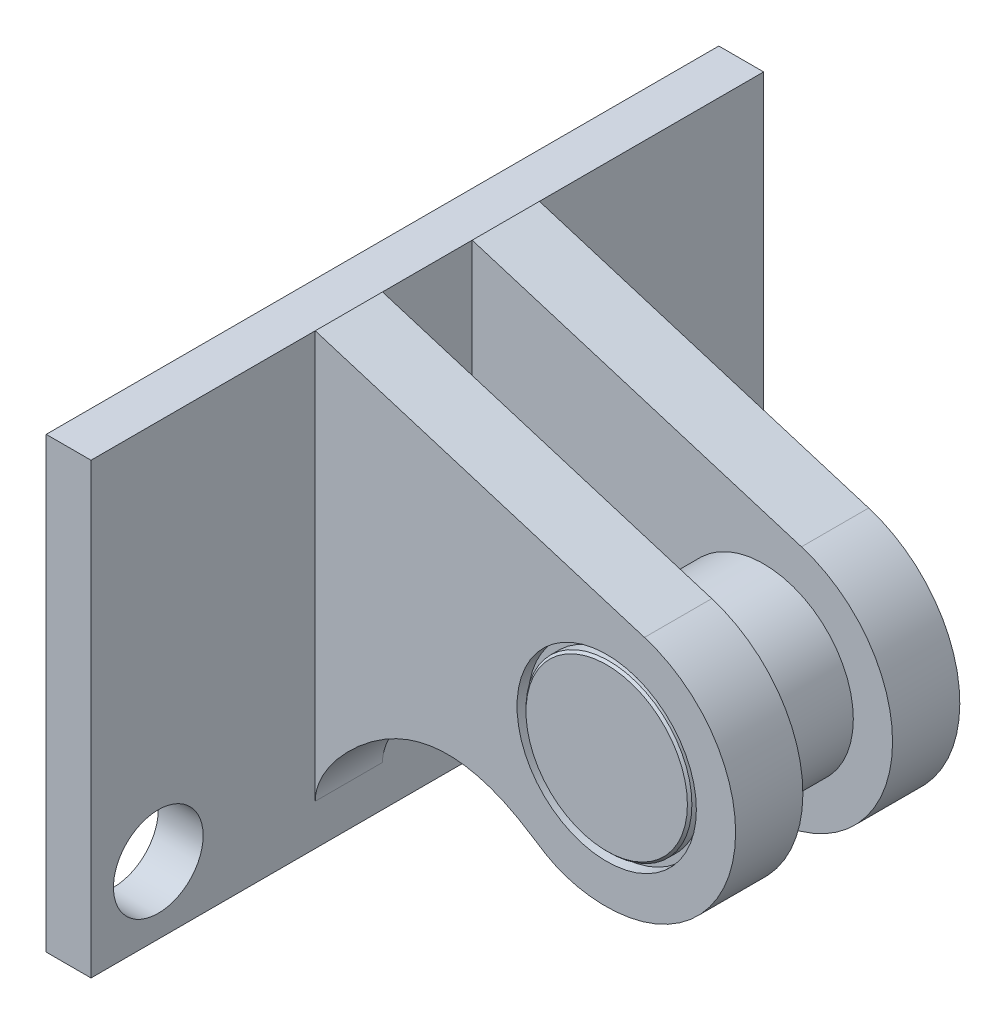
ISO-10303-21;
HEADER;
FILE_DESCRIPTION(('STEP AP214'),'2;1');
FILE_NAME('part.step','',(''),(''),'','','');
FILE_SCHEMA(('AUTOMOTIVE_DESIGN { 1 0 10303 214 1 1 1 1 }'));
ENDSEC;
DATA;
#1=APPLICATION_CONTEXT('core data for automotive mechanical design processes');
#2=APPLICATION_PROTOCOL_DEFINITION('international standard','automotive_design',2000,#1);
#3=PRODUCT_CONTEXT('',#1,'mechanical');
#4=PRODUCT('Part','Part','',(#3));
#5=PRODUCT_RELATED_PRODUCT_CATEGORY('part','',(#4));
#6=PRODUCT_DEFINITION_FORMATION('','',#4);
#7=PRODUCT_DEFINITION_CONTEXT('part definition',#1,'design');
#8=PRODUCT_DEFINITION('design','',#6,#7);
#9=PRODUCT_DEFINITION_SHAPE('','',#8);
#10=(LENGTH_UNIT() NAMED_UNIT(*) SI_UNIT(.MILLI.,.METRE.));
#11=(NAMED_UNIT(*) PLANE_ANGLE_UNIT() SI_UNIT($,.RADIAN.));
#12=(NAMED_UNIT(*) SI_UNIT($,.STERADIAN.) SOLID_ANGLE_UNIT());
#13=UNCERTAINTY_MEASURE_WITH_UNIT(LENGTH_MEASURE(1.E-05),#10,'distance_accuracy_value','');
#14=(GEOMETRIC_REPRESENTATION_CONTEXT(3) GLOBAL_UNCERTAINTY_ASSIGNED_CONTEXT((#13)) GLOBAL_UNIT_ASSIGNED_CONTEXT((#10,
#11,#12)) REPRESENTATION_CONTEXT('',''));
#15=CARTESIAN_POINT('',(0.,0.,0.));
#16=DIRECTION('',(0.,0.,1.));
#17=DIRECTION('',(1.,0.,0.));
#18=AXIS2_PLACEMENT_3D('',#15,#16,#17);
#19=CARTESIAN_POINT('',(19.6597965965987,-12.0057785729841,-16.3137084989848));
#20=DIRECTION('',(0.,0.,1.));
#21=DIRECTION('',(1.,0.,0.));
#22=AXIS2_PLACEMENT_3D('',#19,#20,#21);
#23=CYLINDRICAL_SURFACE('',#22,4.);
#24=CARTESIAN_POINT('',(19.6597965965987,-12.0057785729841,4.5));
#25=DIRECTION('',(0.,0.,1.));
#26=DIRECTION('',(1.,0.,0.));
#27=AXIS2_PLACEMENT_3D('',#24,#25,#26);
#28=CIRCLE('',#27,4.);
#29=CARTESIAN_POINT('',(23.6597965965987,-12.0057785729841,4.5));
#30=VERTEX_POINT('',#29);
#31=EDGE_CURVE('E62',#30,#30,#28,.T.);
#32=ORIENTED_EDGE('',*,*,#31,.F.);
#33=EDGE_LOOP('',(#32));
#34=FACE_BOUND('',#33,.T.);
#35=CARTESIAN_POINT('',(19.6597965965987,-12.0057785729841,-4.5));
#36=DIRECTION('',(0.,0.,1.));
#37=DIRECTION('',(1.,0.,0.));
#38=AXIS2_PLACEMENT_3D('',#35,#36,#37);
#39=CIRCLE('',#38,4.);
#40=CARTESIAN_POINT('',(23.6597965965987,-12.0057785729841,-4.5));
#41=VERTEX_POINT('',#40);
#42=EDGE_CURVE('E68',#41,#41,#39,.T.);
#43=ORIENTED_EDGE('',*,*,#42,.T.);
#44=EDGE_LOOP('',(#43));
#45=FACE_BOUND('',#44,.T.);
#46=ADVANCED_FACE('F42',(#34,#45),#23,.T.);
#47=CARTESIAN_POINT('',(19.6597965965987,-12.0057785729841,4.5));
#48=DIRECTION('',(0.,0.,1.));
#49=DIRECTION('',(1.,0.,0.));
#50=AXIS2_PLACEMENT_3D('',#47,#48,#49);
#51=PLANE('',#50);
#52=CARTESIAN_POINT('',(19.6597965965987,-12.0057785729841,4.5));
#53=DIRECTION('',(0.,0.,1.));
#54=DIRECTION('',(1.,0.,0.));
#55=AXIS2_PLACEMENT_3D('',#52,#53,#54);
#56=CIRCLE('',#55,3.7);
#57=CARTESIAN_POINT('',(23.3597965965987,-12.0057785729841,4.5));
#58=VERTEX_POINT('',#57);
#59=EDGE_CURVE('E65',#58,#58,#56,.T.);
#60=ORIENTED_EDGE('',*,*,#59,.F.);
#61=EDGE_LOOP('',(#60));
#62=FACE_BOUND('',#61,.T.);
#63=ORIENTED_EDGE('',*,*,#31,.T.);
#64=EDGE_LOOP('',(#63));
#65=FACE_BOUND('',#64,.T.);
#66=ADVANCED_FACE('F90',(#62,#65),#51,.T.);
#67=CARTESIAN_POINT('',(19.6597965965987,-12.0057785729841,4.5));
#68=DIRECTION('',(0.,0.,1.));
#69=DIRECTION('',(1.,0.,0.));
#70=AXIS2_PLACEMENT_3D('',#67,#68,#69);
#71=CYLINDRICAL_SURFACE('',#70,3.7);
#72=CARTESIAN_POINT('',(19.6597965965987,-12.0057785729841,4.9));
#73=DIRECTION('',(0.,0.,1.));
#74=DIRECTION('',(1.,0.,0.));
#75=AXIS2_PLACEMENT_3D('',#72,#73,#74);
#76=CIRCLE('',#75,3.7);
#77=CARTESIAN_POINT('',(23.3597965965987,-12.0057785729841,4.9));
#78=VERTEX_POINT('',#77);
#79=EDGE_CURVE('E53',#78,#78,#76,.F.);
#80=ORIENTED_EDGE('',*,*,#79,.T.);
#81=EDGE_LOOP('',(#80));
#82=FACE_BOUND('',#81,.T.);
#83=ORIENTED_EDGE('',*,*,#59,.T.);
#84=EDGE_LOOP('',(#83));
#85=FACE_BOUND('',#84,.T.);
#86=ADVANCED_FACE('F96',(#82,#85),#71,.T.);
#87=CARTESIAN_POINT('',(19.6597965965987,-12.0057785729841,5.));
#88=DIRECTION('',(0.,0.,1.));
#89=DIRECTION('',(1.,0.,0.));
#90=AXIS2_PLACEMENT_3D('',#87,#88,#89);
#91=PLANE('',#90);
#92=CARTESIAN_POINT('',(19.6597965965987,-12.0057785729841,5.));
#93=DIRECTION('',(0.,0.,1.));
#94=DIRECTION('',(1.,0.,0.));
#95=AXIS2_PLACEMENT_3D('',#92,#93,#94);
#96=CIRCLE('',#95,3.6);
#97=CARTESIAN_POINT('',(23.2597965965987,-12.0057785729841,5.));
#98=VERTEX_POINT('',#97);
#99=EDGE_CURVE('E57',#98,#98,#96,.T.);
#100=ORIENTED_EDGE('',*,*,#99,.T.);
#101=EDGE_LOOP('',(#100));
#102=FACE_BOUND('',#101,.T.);
#103=ADVANCED_FACE('F102',(#102),#91,.T.);
#104=CARTESIAN_POINT('',(19.6597965965987,-12.0057785729841,5.));
#105=DIRECTION('',(0.,0.,-1.));
#106=DIRECTION('',(-1.,0.,0.));
#107=AXIS2_PLACEMENT_3D('',#104,#105,#106);
#108=CONICAL_SURFACE('',#107,3.6,0.78539816339745);
#109=ORIENTED_EDGE('',*,*,#79,.F.);
#110=EDGE_LOOP('',(#109));
#111=FACE_BOUND('',#110,.T.);
#112=ORIENTED_EDGE('',*,*,#99,.F.);
#113=EDGE_LOOP('',(#112));
#114=FACE_BOUND('',#113,.T.);
#115=ADVANCED_FACE('F86',(#111,#114),#108,.T.);
#116=CARTESIAN_POINT('',(19.6597965965987,-12.0057785729841,-4.5));
#117=DIRECTION('',(0.,0.,-1.));
#118=DIRECTION('',(1.,0.,0.));
#119=AXIS2_PLACEMENT_3D('',#116,#117,#118);
#120=PLANE('',#119);
#121=ORIENTED_EDGE('',*,*,#42,.F.);
#122=EDGE_LOOP('',(#121));
#123=FACE_BOUND('',#122,.T.);
#124=CARTESIAN_POINT('',(19.6597965965987,-12.0057785729841,-4.5));
#125=DIRECTION('',(0.,0.,1.));
#126=DIRECTION('',(1.,0.,0.));
#127=AXIS2_PLACEMENT_3D('',#124,#125,#126);
#128=CIRCLE('',#127,3.7);
#129=CARTESIAN_POINT('',(23.3597965965987,-12.0057785729841,-4.5));
#130=VERTEX_POINT('',#129);
#131=EDGE_CURVE('E71',#130,#130,#128,.T.);
#132=ORIENTED_EDGE('',*,*,#131,.T.);
#133=EDGE_LOOP('',(#132));
#134=FACE_BOUND('',#133,.T.);
#135=ADVANCED_FACE('F75',(#123,#134),#120,.T.);
#136=CARTESIAN_POINT('',(19.6597965965987,-12.0057785729841,-4.5));
#137=DIRECTION('',(0.,0.,-1.));
#138=DIRECTION('',(-1.,0.,0.));
#139=AXIS2_PLACEMENT_3D('',#136,#137,#138);
#140=CYLINDRICAL_SURFACE('',#139,3.7);
#141=CARTESIAN_POINT('',(19.6597965965987,-12.0057785729841,-4.9));
#142=DIRECTION('',(0.,0.,-1.));
#143=DIRECTION('',(-1.,0.,0.));
#144=AXIS2_PLACEMENT_3D('',#141,#142,#143);
#145=CIRCLE('',#144,3.7);
#146=CARTESIAN_POINT('',(15.9597965965987,-12.0057785729841,-4.9));
#147=VERTEX_POINT('',#146);
#148=EDGE_CURVE('E49',#147,#147,#145,.F.);
#149=ORIENTED_EDGE('',*,*,#148,.T.);
#150=EDGE_LOOP('',(#149));
#151=FACE_BOUND('',#150,.T.);
#152=ORIENTED_EDGE('',*,*,#131,.F.);
#153=EDGE_LOOP('',(#152));
#154=FACE_BOUND('',#153,.T.);
#155=ADVANCED_FACE('F77',(#151,#154),#140,.T.);
#156=CARTESIAN_POINT('',(0.,0.,-5.));
#157=DIRECTION('',(0.,0.,-1.));
#158=DIRECTION('',(1.,0.,0.));
#159=AXIS2_PLACEMENT_3D('',#156,#157,#158);
#160=PLANE('',#159);
#161=CARTESIAN_POINT('',(19.6597965965987,-12.0057785729841,-5.));
#162=DIRECTION('',(0.,0.,-1.));
#163=DIRECTION('',(-1.,0.,0.));
#164=AXIS2_PLACEMENT_3D('',#161,#162,#163);
#165=CIRCLE('',#164,3.6);
#166=CARTESIAN_POINT('',(16.0597965965987,-12.0057785729841,-5.));
#167=VERTEX_POINT('',#166);
#168=EDGE_CURVE('E11',#167,#167,#165,.T.);
#169=ORIENTED_EDGE('',*,*,#168,.T.);
#170=EDGE_LOOP('',(#169));
#171=FACE_BOUND('',#170,.T.);
#172=ADVANCED_FACE('F79',(#171),#160,.T.);
#173=CARTESIAN_POINT('',(19.6597965965987,-12.0057785729841,-4.9));
#174=DIRECTION('',(0.,0.,1.));
#175=DIRECTION('',(1.,0.,0.));
#176=AXIS2_PLACEMENT_3D('',#173,#174,#175);
#177=CONICAL_SURFACE('',#176,3.7,0.785398163397442);
#178=ORIENTED_EDGE('',*,*,#168,.F.);
#179=EDGE_LOOP('',(#178));
#180=FACE_BOUND('',#179,.T.);
#181=ORIENTED_EDGE('',*,*,#148,.F.);
#182=EDGE_LOOP('',(#181));
#183=FACE_BOUND('',#182,.T.);
#184=ADVANCED_FACE('F44',(#180,#183),#177,.T.);
#185=CLOSED_SHELL('',(#46,#66,#86,#103,#115,#135,#155,#172,#184));
#186=MANIFOLD_SOLID_BREP('B2',#185);
#187=CARTESIAN_POINT('',(6.65979659659865,-22.0057785729841,-15.));
#188=DIRECTION('',(0.,0.,1.));
#189=DIRECTION('',(1.,0.,0.));
#190=AXIS2_PLACEMENT_3D('',#187,#188,#189);
#191=PLANE('',#190);
#192=DIRECTION('',(0.,1.,0.));
#193=VECTOR('',#192,1.);
#194=CARTESIAN_POINT('',(4.65979659659865,-22.0057785729841,-15.));
#195=LINE('',#194,#193);
#196=CARTESIAN_POINT('',(4.65979659659865,-22.0057785729841,-15.));
#197=VERTEX_POINT('',#196);
#198=CARTESIAN_POINT('',(4.65979659659865,-2.00577857298413,-15.));
#199=VERTEX_POINT('',#198);
#200=EDGE_CURVE('E363',#197,#199,#195,.T.);
#201=ORIENTED_EDGE('',*,*,#200,.T.);
#202=DIRECTION('',(-1.,0.,0.));
#203=VECTOR('',#202,1.);
#204=CARTESIAN_POINT('',(6.65979659659865,-2.00577857298413,-15.));
#205=LINE('',#204,#203);
#206=CARTESIAN_POINT('',(6.65979659659865,-2.00577857298413,-15.));
#207=VERTEX_POINT('',#206);
#208=EDGE_CURVE('E40',#207,#199,#205,.T.);
#209=ORIENTED_EDGE('',*,*,#208,.F.);
#210=DIRECTION('',(0.,1.,0.));
#211=VECTOR('',#210,1.);
#212=CARTESIAN_POINT('',(6.65979659659865,-22.0057785729841,-15.));
#213=LINE('',#212,#211);
#214=CARTESIAN_POINT('',(6.65979659659865,-22.0057785729841,-15.));
#215=VERTEX_POINT('',#214);
#216=EDGE_CURVE('E372',#215,#207,#213,.T.);
#217=ORIENTED_EDGE('',*,*,#216,.F.);
#218=DIRECTION('',(-1.,0.,0.));
#219=VECTOR('',#218,1.);
#220=CARTESIAN_POINT('',(6.65979659659865,-22.0057785729841,-15.));
#221=LINE('',#220,#219);
#222=EDGE_CURVE('E376',#215,#197,#221,.T.);
#223=ORIENTED_EDGE('',*,*,#222,.T.);
#224=EDGE_LOOP('',(#201,#209,#217,#223));
#225=FACE_BOUND('',#224,.T.);
#226=ADVANCED_FACE('F172',(#225),#191,.F.);
#227=CARTESIAN_POINT('',(6.65979659659865,-2.00577857298413,15.));
#228=DIRECTION('',(0.,-1.,0.));
#229=DIRECTION('',(0.,0.,-1.));
#230=AXIS2_PLACEMENT_3D('',#227,#228,#229);
#231=PLANE('',#230);
#232=DIRECTION('',(0.,0.,1.));
#233=VECTOR('',#232,1.);
#234=CARTESIAN_POINT('',(4.65979659659865,-2.00577857298413,15.));
#235=LINE('',#234,#233);
#236=CARTESIAN_POINT('',(4.65979659659865,-2.00577857298413,15.));
#237=VERTEX_POINT('',#236);
#238=EDGE_CURVE('E353',#199,#237,#235,.T.);
#239=ORIENTED_EDGE('',*,*,#238,.T.);
#240=DIRECTION('',(-1.,0.,0.));
#241=VECTOR('',#240,1.);
#242=CARTESIAN_POINT('',(6.65979659659865,-2.00577857298413,15.));
#243=LINE('',#242,#241);
#244=CARTESIAN_POINT('',(6.65979659659865,-2.00577857298413,15.));
#245=VERTEX_POINT('',#244);
#246=EDGE_CURVE('E179',#245,#237,#243,.T.);
#247=ORIENTED_EDGE('',*,*,#246,.F.);
#248=DIRECTION('',(0.,0.,1.));
#249=VECTOR('',#248,1.);
#250=CARTESIAN_POINT('',(6.65979659659865,-2.00577857298413,15.));
#251=LINE('',#250,#249);
#252=CARTESIAN_POINT('',(6.65979659659865,-2.00577857298413,5.));
#253=VERTEX_POINT('',#252);
#254=EDGE_CURVE('E399',#253,#245,#251,.T.);
#255=ORIENTED_EDGE('',*,*,#254,.F.);
#256=DIRECTION('',(0.,0.,-1.));
#257=VECTOR('',#256,1.);
#258=CARTESIAN_POINT('',(6.65979659659865,-2.00577857298413,5.));
#259=LINE('',#258,#257);
#260=CARTESIAN_POINT('',(6.65979659659865,-2.00577857298413,2.));
#261=VERTEX_POINT('',#260);
#262=EDGE_CURVE('E395',#253,#261,#259,.T.);
#263=ORIENTED_EDGE('',*,*,#262,.T.);
#264=CARTESIAN_POINT('',(6.65979659659865,-2.00577857298413,-2.));
#265=VERTEX_POINT('',#264);
#266=EDGE_CURVE('E400',#265,#261,#251,.T.);
#267=ORIENTED_EDGE('',*,*,#266,.F.);
#268=DIRECTION('',(0.,0.,1.));
#269=VECTOR('',#268,1.);
#270=CARTESIAN_POINT('',(6.65979659659865,-2.00577857298413,-5.));
#271=LINE('',#270,#269);
#272=CARTESIAN_POINT('',(6.65979659659865,-2.00577857298413,-5.));
#273=VERTEX_POINT('',#272);
#274=EDGE_CURVE('E277',#273,#265,#271,.T.);
#275=ORIENTED_EDGE('',*,*,#274,.F.);
#276=EDGE_CURVE('E385',#207,#273,#251,.T.);
#277=ORIENTED_EDGE('',*,*,#276,.F.);
#278=ORIENTED_EDGE('',*,*,#208,.T.);
#279=EDGE_LOOP('',(#239,#247,#255,#263,#267,#275,#277,#278));
#280=FACE_BOUND('',#279,.T.);
#281=ADVANCED_FACE('F344',(#280),#231,.F.);
#282=CARTESIAN_POINT('',(6.65979659659865,-22.0057785729841,15.));
#283=DIRECTION('',(0.,0.,-1.));
#284=DIRECTION('',(-1.,0.,0.));
#285=AXIS2_PLACEMENT_3D('',#282,#283,#284);
#286=PLANE('',#285);
#287=DIRECTION('',(0.,-1.,0.));
#288=VECTOR('',#287,1.);
#289=CARTESIAN_POINT('',(4.65979659659865,-22.0057785729841,15.));
#290=LINE('',#289,#288);
#291=CARTESIAN_POINT('',(4.65979659659865,-22.0057785729841,15.));
#292=VERTEX_POINT('',#291);
#293=EDGE_CURVE('E362',#237,#292,#290,.T.);
#294=ORIENTED_EDGE('',*,*,#293,.T.);
#295=DIRECTION('',(-1.,0.,0.));
#296=VECTOR('',#295,1.);
#297=CARTESIAN_POINT('',(6.65979659659865,-22.0057785729841,15.));
#298=LINE('',#297,#296);
#299=CARTESIAN_POINT('',(6.65979659659865,-22.0057785729841,15.));
#300=VERTEX_POINT('',#299);
#301=EDGE_CURVE('E368',#300,#292,#298,.T.);
#302=ORIENTED_EDGE('',*,*,#301,.F.);
#303=DIRECTION('',(0.,-1.,0.));
#304=VECTOR('',#303,1.);
#305=CARTESIAN_POINT('',(6.65979659659865,-22.0057785729841,15.));
#306=LINE('',#305,#304);
#307=EDGE_CURVE('E367',#245,#300,#306,.T.);
#308=ORIENTED_EDGE('',*,*,#307,.F.);
#309=ORIENTED_EDGE('',*,*,#246,.T.);
#310=EDGE_LOOP('',(#294,#302,#308,#309));
#311=FACE_BOUND('',#310,.T.);
#312=ADVANCED_FACE('F341',(#311),#286,.F.);
#313=CARTESIAN_POINT('',(6.65979659659865,-22.0057785729841,15.));
#314=DIRECTION('',(0.,1.,0.));
#315=DIRECTION('',(0.,0.,1.));
#316=AXIS2_PLACEMENT_3D('',#313,#314,#315);
#317=PLANE('',#316);
#318=DIRECTION('',(0.,0.,-1.));
#319=VECTOR('',#318,1.);
#320=CARTESIAN_POINT('',(4.65979659659865,-22.0057785729841,15.));
#321=LINE('',#320,#319);
#322=EDGE_CURVE('E370',#292,#197,#321,.T.);
#323=ORIENTED_EDGE('',*,*,#322,.T.);
#324=ORIENTED_EDGE('',*,*,#222,.F.);
#325=DIRECTION('',(0.,0.,-1.));
#326=VECTOR('',#325,1.);
#327=CARTESIAN_POINT('',(6.65979659659865,-22.0057785729841,15.));
#328=LINE('',#327,#326);
#329=EDGE_CURVE('E379',#300,#215,#328,.T.);
#330=ORIENTED_EDGE('',*,*,#329,.F.);
#331=ORIENTED_EDGE('',*,*,#301,.T.);
#332=EDGE_LOOP('',(#323,#324,#330,#331));
#333=FACE_BOUND('',#332,.T.);
#334=ADVANCED_FACE('F334',(#333),#317,.F.);
#335=CARTESIAN_POINT('',(6.65979659659865,0.,0.));
#336=DIRECTION('',(-1.,0.,0.));
#337=DIRECTION('',(0.,0.,1.));
#338=AXIS2_PLACEMENT_3D('',#335,#336,#337);
#339=PLANE('',#338);
#340=CARTESIAN_POINT('',(6.65979659659865,-19.0057785729841,12.));
#341=DIRECTION('',(1.,0.,0.));
#342=DIRECTION('',(0.,0.,-1.));
#343=AXIS2_PLACEMENT_3D('',#340,#341,#342);
#344=CIRCLE('',#343,2.);
#345=CARTESIAN_POINT('',(6.65979659659865,-19.0057785729841,10.));
#346=VERTEX_POINT('',#345);
#347=EDGE_CURVE('E293',#346,#346,#344,.T.);
#348=ORIENTED_EDGE('',*,*,#347,.F.);
#349=EDGE_LOOP('',(#348));
#350=FACE_BOUND('',#349,.T.);
#351=ORIENTED_EDGE('',*,*,#276,.T.);
#352=DIRECTION('',(0.,-1.,0.));
#353=VECTOR('',#352,1.);
#354=CARTESIAN_POINT('',(6.65979659659865,0.,-5.));
#355=LINE('',#354,#353);
#356=CARTESIAN_POINT('',(6.65979659659865,-20.1789094707471,-5.));
#357=VERTEX_POINT('',#356);
#358=EDGE_CURVE('E186',#273,#357,#355,.T.);
#359=ORIENTED_EDGE('',*,*,#358,.T.);
#360=DIRECTION('',(0.,0.,1.));
#361=VECTOR('',#360,1.);
#362=CARTESIAN_POINT('',(6.65979659659865,-20.1789094707471,-5.));
#363=LINE('',#362,#361);
#364=CARTESIAN_POINT('',(6.65979659659865,-20.1789094707471,-2.));
#365=VERTEX_POINT('',#364);
#366=EDGE_CURVE('E307',#357,#365,#363,.T.);
#367=ORIENTED_EDGE('',*,*,#366,.T.);
#368=DIRECTION('',(0.,-1.,0.));
#369=VECTOR('',#368,1.);
#370=CARTESIAN_POINT('',(6.65979659659865,0.,-2.));
#371=LINE('',#370,#369);
#372=EDGE_CURVE('E192',#265,#365,#371,.T.);
#373=ORIENTED_EDGE('',*,*,#372,.F.);
#374=ORIENTED_EDGE('',*,*,#266,.T.);
#375=DIRECTION('',(0.,-1.,0.));
#376=VECTOR('',#375,1.);
#377=CARTESIAN_POINT('',(6.65979659659865,0.,2.));
#378=LINE('',#377,#376);
#379=CARTESIAN_POINT('',(6.65979659659865,-20.1789094707471,2.));
#380=VERTEX_POINT('',#379);
#381=EDGE_CURVE('E435',#261,#380,#378,.T.);
#382=ORIENTED_EDGE('',*,*,#381,.T.);
#383=DIRECTION('',(0.,0.,-1.));
#384=VECTOR('',#383,1.);
#385=CARTESIAN_POINT('',(6.65979659659865,-20.1789094707471,5.));
#386=LINE('',#385,#384);
#387=CARTESIAN_POINT('',(6.65979659659865,-20.1789094707471,5.));
#388=VERTEX_POINT('',#387);
#389=EDGE_CURVE('E414',#388,#380,#386,.T.);
#390=ORIENTED_EDGE('',*,*,#389,.F.);
#391=DIRECTION('',(0.,-1.,0.));
#392=VECTOR('',#391,1.);
#393=CARTESIAN_POINT('',(6.65979659659865,0.,5.));
#394=LINE('',#393,#392);
#395=EDGE_CURVE('E402',#253,#388,#394,.T.);
#396=ORIENTED_EDGE('',*,*,#395,.F.);
#397=ORIENTED_EDGE('',*,*,#254,.T.);
#398=ORIENTED_EDGE('',*,*,#307,.T.);
#399=ORIENTED_EDGE('',*,*,#329,.T.);
#400=ORIENTED_EDGE('',*,*,#216,.T.);
#401=EDGE_LOOP('',(#351,#359,#367,#373,#374,#382,#390,#396,#397,#398,#399,#400));
#402=FACE_BOUND('',#401,.T.);
#403=ADVANCED_FACE('F331',(#350,#402),#339,.F.);
#404=CARTESIAN_POINT('',(4.65979659659865,0.,0.));
#405=DIRECTION('',(-1.,0.,0.));
#406=DIRECTION('',(0.,0.,1.));
#407=AXIS2_PLACEMENT_3D('',#404,#405,#406);
#408=PLANE('',#407);
#409=CARTESIAN_POINT('',(4.65979659659865,-19.0057785729841,12.));
#410=DIRECTION('',(-1.,0.,0.));
#411=DIRECTION('',(0.,0.,1.));
#412=AXIS2_PLACEMENT_3D('',#409,#410,#411);
#413=CIRCLE('',#412,2.);
#414=CARTESIAN_POINT('',(4.65979659659865,-19.0057785729841,14.));
#415=VERTEX_POINT('',#414);
#416=EDGE_CURVE('E469',#415,#415,#413,.F.);
#417=ORIENTED_EDGE('',*,*,#416,.T.);
#418=EDGE_LOOP('',(#417));
#419=FACE_BOUND('',#418,.T.);
#420=ORIENTED_EDGE('',*,*,#200,.F.);
#421=ORIENTED_EDGE('',*,*,#322,.F.);
#422=ORIENTED_EDGE('',*,*,#293,.F.);
#423=ORIENTED_EDGE('',*,*,#238,.F.);
#424=EDGE_LOOP('',(#420,#421,#422,#423));
#425=FACE_BOUND('',#424,.T.);
#426=ADVANCED_FACE('F328',(#419,#425),#408,.T.);
#427=CARTESIAN_POINT('',(20.6747979890145,-17.6654845877338,5.));
#428=CARTESIAN_POINT('',(19.5348790524565,-17.8699155784659,5.));
#429=CARTESIAN_POINT('',(17.7926975590444,-17.7150413389851,5.));
#430=CARTESIAN_POINT('',(14.4777828299521,-15.3673325494348,5.));
#431=CARTESIAN_POINT('',(10.5193545293985,-14.5251604844178,5.));
#432=CARTESIAN_POINT('',(6.65979659659864,-19.0081465231709,5.));
#433=CARTESIAN_POINT('',(6.65979659659865,-20.1789094707471,5.));
#434=B_SPLINE_CURVE_WITH_KNOTS('',3,(#427,#428,#429,#430,#431,#432,#433),.UNSPECIFIED.,.F.,.F.,
(4,1,1,1,4),(0.,0.229346230109386,0.30602612492106,0.766798948116745,1.),.UNSPECIFIED.);
#435=DIRECTION('',(0.,0.,-1.));
#436=VECTOR('',#435,1.);
#437=SURFACE_OF_LINEAR_EXTRUSION('',#434,#436);
#438=CARTESIAN_POINT('',(20.6747979890145,-17.6654845877338,2.));
#439=CARTESIAN_POINT('',(19.5348790524565,-17.8699155784659,2.));
#440=CARTESIAN_POINT('',(17.7926975590444,-17.7150413389851,2.));
#441=CARTESIAN_POINT('',(14.4777828299521,-15.3673325494348,2.));
#442=CARTESIAN_POINT('',(10.5193545293985,-14.5251604844178,2.));
#443=CARTESIAN_POINT('',(6.65979659659864,-19.0081465231709,2.));
#444=CARTESIAN_POINT('',(6.65979659659865,-20.1789094707471,2.));
#445=B_SPLINE_CURVE_WITH_KNOTS('',3,(#438,#439,#440,#441,#442,#443,#444),.UNSPECIFIED.,.F.,.F.,
(4,1,1,1,4),(0.,0.229346230109386,0.30602612492106,0.766798948116745,1.),.UNSPECIFIED.);
#446=CARTESIAN_POINT('',(20.6747979890145,-17.6654845877338,2.));
#447=VERTEX_POINT('',#446);
#448=EDGE_CURVE('E309',#447,#380,#445,.T.);
#449=ORIENTED_EDGE('',*,*,#448,.F.);
#450=DIRECTION('',(0.,0.,-1.));
#451=VECTOR('',#450,1.);
#452=CARTESIAN_POINT('',(20.6747979890145,-17.6654845877338,5.));
#453=LINE('',#452,#451);
#454=CARTESIAN_POINT('',(20.6747979890145,-17.6654845877338,5.));
#455=VERTEX_POINT('',#454);
#456=EDGE_CURVE('E388',#455,#447,#453,.T.);
#457=ORIENTED_EDGE('',*,*,#456,.F.);
#458=EDGE_CURVE('E310',#455,#388,#434,.T.);
#459=ORIENTED_EDGE('',*,*,#458,.T.);
#460=ORIENTED_EDGE('',*,*,#389,.T.);
#461=EDGE_LOOP('',(#449,#457,#459,#460));
#462=FACE_BOUND('',#461,.T.);
#463=ADVANCED_FACE('F323',(#462),#437,.T.);
#464=CARTESIAN_POINT('',(19.6597965965987,-12.0057785729841,5.));
#465=DIRECTION('',(0.,0.,-1.));
#466=DIRECTION('',(-1.,0.,0.));
#467=AXIS2_PLACEMENT_3D('',#464,#465,#466);
#468=CYLINDRICAL_SURFACE('',#467,5.75);
#469=CARTESIAN_POINT('',(19.6597965965987,-12.0057785729841,2.));
#470=DIRECTION('',(0.,0.,1.));
#471=DIRECTION('',(1.,0.,0.));
#472=AXIS2_PLACEMENT_3D('',#469,#470,#471);
#473=CIRCLE('',#472,5.75);
#474=CARTESIAN_POINT('',(21.3453069559298,-6.50836510585366,2.));
#475=VERTEX_POINT('',#474);
#476=EDGE_CURVE('E429',#447,#475,#473,.T.);
#477=ORIENTED_EDGE('',*,*,#476,.T.);
#478=DIRECTION('',(0.,0.,-1.));
#479=VECTOR('',#478,1.);
#480=CARTESIAN_POINT('',(21.3453069559298,-6.50836510585366,5.));
#481=LINE('',#480,#479);
#482=CARTESIAN_POINT('',(21.3453069559298,-6.50836510585366,5.));
#483=VERTEX_POINT('',#482);
#484=EDGE_CURVE('E389',#483,#475,#481,.T.);
#485=ORIENTED_EDGE('',*,*,#484,.F.);
#486=CARTESIAN_POINT('',(19.6597965965987,-12.0057785729841,5.));
#487=DIRECTION('',(0.,0.,1.));
#488=DIRECTION('',(1.,0.,0.));
#489=AXIS2_PLACEMENT_3D('',#486,#487,#488);
#490=CIRCLE('',#489,5.75);
#491=EDGE_CURVE('E316',#455,#483,#490,.T.);
#492=ORIENTED_EDGE('',*,*,#491,.F.);
#493=ORIENTED_EDGE('',*,*,#456,.T.);
#494=EDGE_LOOP('',(#477,#485,#492,#493));
#495=FACE_BOUND('',#494,.T.);
#496=ADVANCED_FACE('F327',(#495),#468,.T.);
#497=CARTESIAN_POINT('',(0.0101225961112229,0.0330155764846455,5.));
#498=DIRECTION('',(0.293132236405414,0.956071907327038,0.));
#499=DIRECTION('',(-0.956071907327038,0.293132236405414,0.));
#500=AXIS2_PLACEMENT_3D('',#497,#498,#499);
#501=PLANE('',#500);
#502=DIRECTION('',(0.956071907327038,-0.293132236405414,0.));
#503=VECTOR('',#502,1.);
#504=CARTESIAN_POINT('',(0.0101225961112229,0.0330155764846455,2.));
#505=LINE('',#504,#503);
#506=EDGE_CURVE('E413',#261,#475,#505,.T.);
#507=ORIENTED_EDGE('',*,*,#506,.F.);
#508=ORIENTED_EDGE('',*,*,#262,.F.);
#509=DIRECTION('',(0.956071907327038,-0.293132236405414,0.));
#510=VECTOR('',#509,1.);
#511=CARTESIAN_POINT('',(0.0101225961112229,0.0330155764846455,5.));
#512=LINE('',#511,#510);
#513=EDGE_CURVE('E411',#253,#483,#512,.T.);
#514=ORIENTED_EDGE('',*,*,#513,.T.);
#515=ORIENTED_EDGE('',*,*,#484,.T.);
#516=EDGE_LOOP('',(#507,#508,#514,#515));
#517=FACE_BOUND('',#516,.T.);
#518=ADVANCED_FACE('F410',(#517),#501,.T.);
#519=CARTESIAN_POINT('',(19.6597965965987,-12.0057785729841,5.));
#520=DIRECTION('',(0.,0.,-1.));
#521=DIRECTION('',(-1.,0.,0.));
#522=AXIS2_PLACEMENT_3D('',#519,#520,#521);
#523=CYLINDRICAL_SURFACE('',#522,4.);
#524=CARTESIAN_POINT('',(19.6597965965987,-12.0057785729841,5.));
#525=DIRECTION('',(0.,0.,1.));
#526=DIRECTION('',(1.,0.,0.));
#527=AXIS2_PLACEMENT_3D('',#524,#525,#526);
#528=CIRCLE('',#527,4.);
#529=CARTESIAN_POINT('',(23.6597965965987,-12.0057785729841,5.));
#530=VERTEX_POINT('',#529);
#531=EDGE_CURVE('E420',#530,#530,#528,.T.);
#532=ORIENTED_EDGE('',*,*,#531,.T.);
#533=EDGE_LOOP('',(#532));
#534=FACE_BOUND('',#533,.T.);
#535=CARTESIAN_POINT('',(19.6597965965987,-12.0057785729841,2.));
#536=DIRECTION('',(0.,0.,1.));
#537=DIRECTION('',(1.,0.,0.));
#538=AXIS2_PLACEMENT_3D('',#535,#536,#537);
#539=CIRCLE('',#538,4.);
#540=CARTESIAN_POINT('',(23.6597965965987,-12.0057785729841,2.));
#541=VERTEX_POINT('',#540);
#542=EDGE_CURVE('E317',#541,#541,#539,.T.);
#543=ORIENTED_EDGE('',*,*,#542,.F.);
#544=EDGE_LOOP('',(#543));
#545=FACE_BOUND('',#544,.T.);
#546=ADVANCED_FACE('F448',(#534,#545),#523,.F.);
#547=CARTESIAN_POINT('',(0.,0.,5.));
#548=DIRECTION('',(0.,0.,1.));
#549=DIRECTION('',(1.,0.,0.));
#550=AXIS2_PLACEMENT_3D('',#547,#548,#549);
#551=PLANE('',#550);
#552=ORIENTED_EDGE('',*,*,#458,.F.);
#553=ORIENTED_EDGE('',*,*,#491,.T.);
#554=ORIENTED_EDGE('',*,*,#513,.F.);
#555=ORIENTED_EDGE('',*,*,#395,.T.);
#556=EDGE_LOOP('',(#552,#553,#554,#555));
#557=FACE_BOUND('',#556,.T.);
#558=ORIENTED_EDGE('',*,*,#531,.F.);
#559=EDGE_LOOP('',(#558));
#560=FACE_BOUND('',#559,.T.);
#561=ADVANCED_FACE('F417',(#557,#560),#551,.T.);
#562=CARTESIAN_POINT('',(0.,0.,2.));
#563=DIRECTION('',(0.,0.,1.));
#564=DIRECTION('',(1.,0.,0.));
#565=AXIS2_PLACEMENT_3D('',#562,#563,#564);
#566=PLANE('',#565);
#567=ORIENTED_EDGE('',*,*,#448,.T.);
#568=ORIENTED_EDGE('',*,*,#381,.F.);
#569=ORIENTED_EDGE('',*,*,#506,.T.);
#570=ORIENTED_EDGE('',*,*,#476,.F.);
#571=EDGE_LOOP('',(#567,#568,#569,#570));
#572=FACE_BOUND('',#571,.T.);
#573=ORIENTED_EDGE('',*,*,#542,.T.);
#574=EDGE_LOOP('',(#573));
#575=FACE_BOUND('',#574,.T.);
#576=ADVANCED_FACE('F442',(#572,#575),#566,.F.);
#577=CARTESIAN_POINT('',(20.6747979890145,-17.6654845877338,-5.));
#578=CARTESIAN_POINT('',(19.5348790524565,-17.8699155784659,-5.));
#579=CARTESIAN_POINT('',(17.7926975590444,-17.7150413389851,-5.));
#580=CARTESIAN_POINT('',(14.4777828299521,-15.3673325494348,-5.));
#581=CARTESIAN_POINT('',(10.5193545293985,-14.5251604844178,-5.));
#582=CARTESIAN_POINT('',(6.65979659659864,-19.0081465231709,-5.));
#583=CARTESIAN_POINT('',(6.65979659659865,-20.1789094707471,-5.));
#584=B_SPLINE_CURVE_WITH_KNOTS('',3,(#577,#578,#579,#580,#581,#582,#583),.UNSPECIFIED.,.F.,.F.,
(4,1,1,1,4),(0.,0.229346230109386,0.30602612492106,0.766798948116745,1.),.UNSPECIFIED.);
#585=DIRECTION('',(0.,0.,1.));
#586=VECTOR('',#585,1.);
#587=SURFACE_OF_LINEAR_EXTRUSION('',#584,#586);
#588=CARTESIAN_POINT('',(20.6747979890145,-17.6654845877338,-2.));
#589=CARTESIAN_POINT('',(19.5348790524565,-17.8699155784659,-2.));
#590=CARTESIAN_POINT('',(17.7926975590444,-17.7150413389851,-2.));
#591=CARTESIAN_POINT('',(14.4777828299521,-15.3673325494348,-2.));
#592=CARTESIAN_POINT('',(10.5193545293985,-14.5251604844178,-2.));
#593=CARTESIAN_POINT('',(6.65979659659864,-19.0081465231709,-2.));
#594=CARTESIAN_POINT('',(6.65979659659865,-20.1789094707471,-2.));
#595=B_SPLINE_CURVE_WITH_KNOTS('',3,(#588,#589,#590,#591,#592,#593,#594),.UNSPECIFIED.,.F.,.F.,
(4,1,1,1,4),(0.,0.229346230109386,0.30602612492106,0.766798948116745,1.),.UNSPECIFIED.);
#596=CARTESIAN_POINT('',(20.6747979890145,-17.6654845877338,-2.));
#597=VERTEX_POINT('',#596);
#598=EDGE_CURVE('E288',#597,#365,#595,.T.);
#599=ORIENTED_EDGE('',*,*,#598,.T.);
#600=ORIENTED_EDGE('',*,*,#366,.F.);
#601=CARTESIAN_POINT('',(20.6747979890145,-17.6654845877338,-5.));
#602=VERTEX_POINT('',#601);
#603=EDGE_CURVE('E304',#602,#357,#584,.T.);
#604=ORIENTED_EDGE('',*,*,#603,.F.);
#605=DIRECTION('',(0.,0.,1.));
#606=VECTOR('',#605,1.);
#607=CARTESIAN_POINT('',(20.6747979890145,-17.6654845877338,-5.));
#608=LINE('',#607,#606);
#609=EDGE_CURVE('E278',#602,#597,#608,.T.);
#610=ORIENTED_EDGE('',*,*,#609,.T.);
#611=EDGE_LOOP('',(#599,#600,#604,#610));
#612=FACE_BOUND('',#611,.T.);
#613=ADVANCED_FACE('F457',(#612),#587,.F.);
#614=CARTESIAN_POINT('',(0.0101225961112229,0.0330155764846455,-5.));
#615=DIRECTION('',(-0.293132236405414,-0.956071907327038,0.));
#616=DIRECTION('',(0.956071907327038,-0.293132236405414,0.));
#617=AXIS2_PLACEMENT_3D('',#614,#615,#616);
#618=PLANE('',#617);
#619=DIRECTION('',(0.956071907327038,-0.293132236405414,0.));
#620=VECTOR('',#619,1.);
#621=CARTESIAN_POINT('',(0.0101225961112229,0.0330155764846455,-2.));
#622=LINE('',#621,#620);
#623=CARTESIAN_POINT('',(21.3453069559298,-6.50836510585366,-2.));
#624=VERTEX_POINT('',#623);
#625=EDGE_CURVE('E273',#265,#624,#622,.T.);
#626=ORIENTED_EDGE('',*,*,#625,.T.);
#627=DIRECTION('',(0.,0.,1.));
#628=VECTOR('',#627,1.);
#629=CARTESIAN_POINT('',(21.3453069559298,-6.50836510585366,-5.));
#630=LINE('',#629,#628);
#631=CARTESIAN_POINT('',(21.3453069559298,-6.50836510585366,-5.));
#632=VERTEX_POINT('',#631);
#633=EDGE_CURVE('E270',#632,#624,#630,.T.);
#634=ORIENTED_EDGE('',*,*,#633,.F.);
#635=DIRECTION('',(0.956071907327038,-0.293132236405414,0.));
#636=VECTOR('',#635,1.);
#637=CARTESIAN_POINT('',(0.0101225961112229,0.0330155764846455,-5.));
#638=LINE('',#637,#636);
#639=EDGE_CURVE('E260',#273,#632,#638,.T.);
#640=ORIENTED_EDGE('',*,*,#639,.F.);
#641=ORIENTED_EDGE('',*,*,#274,.T.);
#642=EDGE_LOOP('',(#626,#634,#640,#641));
#643=FACE_BOUND('',#642,.T.);
#644=ADVANCED_FACE('F271',(#643),#618,.F.);
#645=CARTESIAN_POINT('',(19.6597965965987,-12.0057785729841,-5.));
#646=DIRECTION('',(0.,0.,1.));
#647=DIRECTION('',(1.,0.,0.));
#648=AXIS2_PLACEMENT_3D('',#645,#646,#647);
#649=CYLINDRICAL_SURFACE('',#648,5.75);
#650=CARTESIAN_POINT('',(19.6597965965987,-12.0057785729841,-2.));
#651=DIRECTION('',(0.,0.,1.));
#652=DIRECTION('',(1.,0.,0.));
#653=AXIS2_PLACEMENT_3D('',#650,#651,#652);
#654=CIRCLE('',#653,5.75);
#655=EDGE_CURVE('E299',#597,#624,#654,.T.);
#656=ORIENTED_EDGE('',*,*,#655,.F.);
#657=ORIENTED_EDGE('',*,*,#609,.F.);
#658=CARTESIAN_POINT('',(19.6597965965987,-12.0057785729841,-5.));
#659=DIRECTION('',(0.,0.,1.));
#660=DIRECTION('',(1.,0.,0.));
#661=AXIS2_PLACEMENT_3D('',#658,#659,#660);
#662=CIRCLE('',#661,5.75);
#663=EDGE_CURVE('E265',#602,#632,#662,.T.);
#664=ORIENTED_EDGE('',*,*,#663,.T.);
#665=ORIENTED_EDGE('',*,*,#633,.T.);
#666=EDGE_LOOP('',(#656,#657,#664,#665));
#667=FACE_BOUND('',#666,.T.);
#668=ADVANCED_FACE('F280',(#667),#649,.T.);
#669=CARTESIAN_POINT('',(19.6597965965987,-12.0057785729841,-5.));
#670=DIRECTION('',(0.,0.,1.));
#671=DIRECTION('',(1.,0.,0.));
#672=AXIS2_PLACEMENT_3D('',#669,#670,#671);
#673=CYLINDRICAL_SURFACE('',#672,4.);
#674=CARTESIAN_POINT('',(19.6597965965987,-12.0057785729841,-5.));
#675=DIRECTION('',(0.,0.,1.));
#676=DIRECTION('',(1.,0.,0.));
#677=AXIS2_PLACEMENT_3D('',#674,#675,#676);
#678=CIRCLE('',#677,4.);
#679=CARTESIAN_POINT('',(23.6597965965987,-12.0057785729841,-5.));
#680=VERTEX_POINT('',#679);
#681=EDGE_CURVE('E282',#680,#680,#678,.T.);
#682=ORIENTED_EDGE('',*,*,#681,.F.);
#683=EDGE_LOOP('',(#682));
#684=FACE_BOUND('',#683,.T.);
#685=CARTESIAN_POINT('',(19.6597965965987,-12.0057785729841,-2.));
#686=DIRECTION('',(0.,0.,1.));
#687=DIRECTION('',(1.,0.,0.));
#688=AXIS2_PLACEMENT_3D('',#685,#686,#687);
#689=CIRCLE('',#688,4.);
#690=CARTESIAN_POINT('',(23.6597965965987,-12.0057785729841,-2.));
#691=VERTEX_POINT('',#690);
#692=EDGE_CURVE('E301',#691,#691,#689,.T.);
#693=ORIENTED_EDGE('',*,*,#692,.T.);
#694=EDGE_LOOP('',(#693));
#695=FACE_BOUND('',#694,.T.);
#696=ADVANCED_FACE('F491',(#684,#695),#673,.F.);
#697=CARTESIAN_POINT('',(0.,0.,-5.));
#698=DIRECTION('',(0.,0.,-1.));
#699=DIRECTION('',(1.,0.,0.));
#700=AXIS2_PLACEMENT_3D('',#697,#698,#699);
#701=PLANE('',#700);
#702=ORIENTED_EDGE('',*,*,#603,.T.);
#703=ORIENTED_EDGE('',*,*,#358,.F.);
#704=ORIENTED_EDGE('',*,*,#639,.T.);
#705=ORIENTED_EDGE('',*,*,#663,.F.);
#706=EDGE_LOOP('',(#702,#703,#704,#705));
#707=FACE_BOUND('',#706,.T.);
#708=ORIENTED_EDGE('',*,*,#681,.T.);
#709=EDGE_LOOP('',(#708));
#710=FACE_BOUND('',#709,.T.);
#711=ADVANCED_FACE('F262',(#707,#710),#701,.T.);
#712=CARTESIAN_POINT('',(0.,0.,-2.));
#713=DIRECTION('',(0.,0.,-1.));
#714=DIRECTION('',(1.,0.,0.));
#715=AXIS2_PLACEMENT_3D('',#712,#713,#714);
#716=PLANE('',#715);
#717=ORIENTED_EDGE('',*,*,#598,.F.);
#718=ORIENTED_EDGE('',*,*,#655,.T.);
#719=ORIENTED_EDGE('',*,*,#625,.F.);
#720=ORIENTED_EDGE('',*,*,#372,.T.);
#721=EDGE_LOOP('',(#717,#718,#719,#720));
#722=FACE_BOUND('',#721,.T.);
#723=ORIENTED_EDGE('',*,*,#692,.F.);
#724=EDGE_LOOP('',(#723));
#725=FACE_BOUND('',#724,.T.);
#726=ADVANCED_FACE('F480',(#722,#725),#716,.F.);
#727=CARTESIAN_POINT('',(4.65879659659865,-19.0057785729841,12.));
#728=DIRECTION('',(1.,0.,0.));
#729=DIRECTION('',(0.,0.,-1.));
#730=AXIS2_PLACEMENT_3D('',#727,#728,#729);
#731=CYLINDRICAL_SURFACE('',#730,2.);
#732=ORIENTED_EDGE('',*,*,#416,.F.);
#733=EDGE_LOOP('',(#732));
#734=FACE_BOUND('',#733,.T.);
#735=ORIENTED_EDGE('',*,*,#347,.T.);
#736=EDGE_LOOP('',(#735));
#737=FACE_BOUND('',#736,.T.);
#738=ADVANCED_FACE('F478',(#734,#737),#731,.F.);
#739=CLOSED_SHELL('',(#226,#281,#312,#334,#403,#426,#463,#496,#518,#546,#561,#576,#613,#644,
#668,#696,#711,#726,#738));
#740=MANIFOLD_SOLID_BREP('B6',#739);
#741=ADVANCED_BREP_SHAPE_REPRESENTATION('',(#18,#186,#740),#14);
#742=SHAPE_DEFINITION_REPRESENTATION(#9,#741);
ENDSEC;
END-ISO-10303-21;
